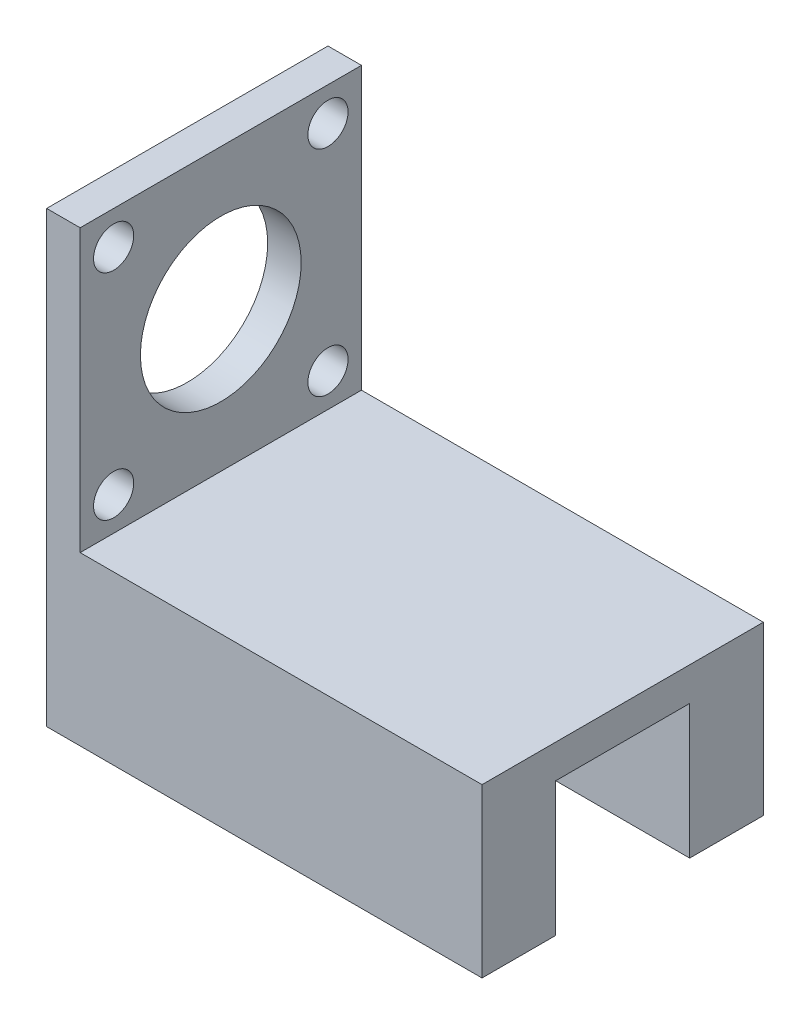
ISO-10303-21;
HEADER;
FILE_DESCRIPTION(('STEP AP214'),'2;1');
FILE_NAME('part.step','',(''),(''),'','','');
FILE_SCHEMA(('AUTOMOTIVE_DESIGN { 1 0 10303 214 1 1 1 1 }'));
ENDSEC;
DATA;
#1=APPLICATION_CONTEXT('core data for automotive mechanical design processes');
#2=APPLICATION_PROTOCOL_DEFINITION('international standard','automotive_design',2000,#1);
#3=PRODUCT_CONTEXT('',#1,'mechanical');
#4=PRODUCT('Part','Part','',(#3));
#5=PRODUCT_RELATED_PRODUCT_CATEGORY('part','',(#4));
#6=PRODUCT_DEFINITION_FORMATION('','',#4);
#7=PRODUCT_DEFINITION_CONTEXT('part definition',#1,'design');
#8=PRODUCT_DEFINITION('design','',#6,#7);
#9=PRODUCT_DEFINITION_SHAPE('','',#8);
#10=(LENGTH_UNIT() NAMED_UNIT(*) SI_UNIT(.MILLI.,.METRE.));
#11=(NAMED_UNIT(*) PLANE_ANGLE_UNIT() SI_UNIT($,.RADIAN.));
#12=(NAMED_UNIT(*) SI_UNIT($,.STERADIAN.) SOLID_ANGLE_UNIT());
#13=UNCERTAINTY_MEASURE_WITH_UNIT(LENGTH_MEASURE(1.E-05),#10,'distance_accuracy_value','');
#14=(GEOMETRIC_REPRESENTATION_CONTEXT(3) GLOBAL_UNCERTAINTY_ASSIGNED_CONTEXT((#13)) GLOBAL_UNIT_ASSIGNED_CONTEXT((#10,
#11,#12)) REPRESENTATION_CONTEXT('',''));
#15=CARTESIAN_POINT('',(0.,0.,0.));
#16=DIRECTION('',(0.,0.,1.));
#17=DIRECTION('',(1.,0.,0.));
#18=AXIS2_PLACEMENT_3D('',#15,#16,#17);
#19=CARTESIAN_POINT('',(-24.4859813084112,20.,0.));
#20=DIRECTION('',(1.,0.,0.));
#21=DIRECTION('',(0.,0.,-1.));
#22=AXIS2_PLACEMENT_3D('',#19,#20,#21);
#23=PLANE('',#22);
#24=CARTESIAN_POINT('',(-24.4859813084112,30.0000000000002,28.0264781796362));
#25=DIRECTION('',(1.,0.,0.));
#26=DIRECTION('',(0.,0.,-1.));
#27=AXIS2_PLACEMENT_3D('',#24,#25,#26);
#28=CIRCLE('',#27,3.);
#29=CARTESIAN_POINT('',(-24.4859813084112,30.0000000000002,25.0264781796362));
#30=VERTEX_POINT('',#29);
#31=EDGE_CURVE('E134',#30,#30,#28,.T.);
#32=ORIENTED_EDGE('',*,*,#31,.T.);
#33=EDGE_LOOP('',(#32));
#34=FACE_BOUND('',#33,.T.);
#35=CARTESIAN_POINT('',(-24.4859813084112,30.0000000000004,-3.97352182036384));
#36=DIRECTION('',(1.,0.,0.));
#37=DIRECTION('',(0.,0.,-1.));
#38=AXIS2_PLACEMENT_3D('',#35,#36,#37);
#39=CIRCLE('',#38,3.00000000000001);
#40=CARTESIAN_POINT('',(-24.4859813084112,30.0000000000004,-6.97352182036385));
#41=VERTEX_POINT('',#40);
#42=EDGE_CURVE('E218',#41,#41,#39,.T.);
#43=ORIENTED_EDGE('',*,*,#42,.T.);
#44=EDGE_LOOP('',(#43));
#45=FACE_BOUND('',#44,.T.);
#46=CARTESIAN_POINT('',(-24.4859813084112,62.0000000000004,-3.97352182036356));
#47=DIRECTION('',(1.,0.,0.));
#48=DIRECTION('',(0.,0.,-1.));
#49=AXIS2_PLACEMENT_3D('',#46,#47,#48);
#50=CIRCLE('',#49,3.);
#51=CARTESIAN_POINT('',(-24.4859813084112,62.0000000000004,-6.97352182036357));
#52=VERTEX_POINT('',#51);
#53=EDGE_CURVE('E221',#52,#52,#50,.T.);
#54=ORIENTED_EDGE('',*,*,#53,.T.);
#55=EDGE_LOOP('',(#54));
#56=FACE_BOUND('',#55,.T.);
#57=CARTESIAN_POINT('',(-24.4859813084112,62.,28.0264781796365));
#58=DIRECTION('',(1.,0.,0.));
#59=DIRECTION('',(0.,0.,-1.));
#60=AXIS2_PLACEMENT_3D('',#57,#58,#59);
#61=CIRCLE('',#60,3.);
#62=CARTESIAN_POINT('',(-24.4859813084112,62.,25.0264781796365));
#63=VERTEX_POINT('',#62);
#64=EDGE_CURVE('E224',#63,#63,#61,.T.);
#65=ORIENTED_EDGE('',*,*,#64,.T.);
#66=EDGE_LOOP('',(#65));
#67=FACE_BOUND('',#66,.T.);
#68=CARTESIAN_POINT('',(-24.4859813084112,46.,12.0264781796365));
#69=DIRECTION('',(1.,0.,0.));
#70=DIRECTION('',(0.,0.,-1.));
#71=AXIS2_PLACEMENT_3D('',#68,#69,#70);
#72=CIRCLE('',#71,12.);
#73=CARTESIAN_POINT('',(-24.4859813084112,46.,0.0264781796364844));
#74=VERTEX_POINT('',#73);
#75=EDGE_CURVE('E227',#74,#74,#72,.T.);
#76=ORIENTED_EDGE('',*,*,#75,.T.);
#77=EDGE_LOOP('',(#76));
#78=FACE_BOUND('',#77,.T.);
#79=DIRECTION('',(0.,0.,1.));
#80=VECTOR('',#79,1.);
#81=CARTESIAN_POINT('',(-24.4859813084112,0.,0.));
#82=LINE('',#81,#80);
#83=CARTESIAN_POINT('',(-24.4859813084112,0.,-8.97352182036352));
#84=VERTEX_POINT('',#83);
#85=CARTESIAN_POINT('',(-24.4859813084112,0.,2.02647817963648));
#86=VERTEX_POINT('',#85);
#87=EDGE_CURVE('E101',#84,#86,#82,.T.);
#88=ORIENTED_EDGE('',*,*,#87,.T.);
#89=DIRECTION('',(0.,-1.,0.));
#90=VECTOR('',#89,1.);
#91=CARTESIAN_POINT('',(-24.4859813084112,20.,2.02647817963648));
#92=LINE('',#91,#90);
#93=CARTESIAN_POINT('',(-24.4859813084112,20.,2.02647817963648));
#94=VERTEX_POINT('',#93);
#95=EDGE_CURVE('E11',#94,#86,#92,.T.);
#96=ORIENTED_EDGE('',*,*,#95,.F.);
#97=DIRECTION('',(0.,0.,1.));
#98=VECTOR('',#97,1.);
#99=CARTESIAN_POINT('',(-24.4859813084112,20.,-8.97352182036352));
#100=LINE('',#99,#98);
#101=CARTESIAN_POINT('',(-24.4859813084112,20.,22.0264781796365));
#102=VERTEX_POINT('',#101);
#103=EDGE_CURVE('E159',#94,#102,#100,.T.);
#104=ORIENTED_EDGE('',*,*,#103,.T.);
#105=DIRECTION('',(0.,-1.,0.));
#106=VECTOR('',#105,1.);
#107=CARTESIAN_POINT('',(-24.4859813084112,20.,22.0264781796365));
#108=LINE('',#107,#106);
#109=CARTESIAN_POINT('',(-24.4859813084112,0.,22.0264781796365));
#110=VERTEX_POINT('',#109);
#111=EDGE_CURVE('E142',#102,#110,#108,.T.);
#112=ORIENTED_EDGE('',*,*,#111,.T.);
#113=DIRECTION('',(0.,0.,1.));
#114=VECTOR('',#113,1.);
#115=CARTESIAN_POINT('',(-24.4859813084112,0.,0.));
#116=LINE('',#115,#114);
#117=CARTESIAN_POINT('',(-24.4859813084112,0.,33.0264781796365));
#118=VERTEX_POINT('',#117);
#119=EDGE_CURVE('E143',#110,#118,#116,.T.);
#120=ORIENTED_EDGE('',*,*,#119,.T.);
#121=DIRECTION('',(0.,-1.,0.));
#122=VECTOR('',#121,1.);
#123=CARTESIAN_POINT('',(-24.4859813084112,25.,33.0264781796365));
#124=LINE('',#123,#122);
#125=CARTESIAN_POINT('',(-24.4859813084112,67.,33.0264781796365));
#126=VERTEX_POINT('',#125);
#127=EDGE_CURVE('E172',#126,#118,#124,.T.);
#128=ORIENTED_EDGE('',*,*,#127,.F.);
#129=DIRECTION('',(0.,0.,1.));
#130=VECTOR('',#129,1.);
#131=CARTESIAN_POINT('',(-24.4859813084112,67.,33.0264781796365));
#132=LINE('',#131,#130);
#133=CARTESIAN_POINT('',(-24.4859813084112,67.,-8.97352182036352));
#134=VERTEX_POINT('',#133);
#135=EDGE_CURVE('E111',#134,#126,#132,.T.);
#136=ORIENTED_EDGE('',*,*,#135,.F.);
#137=DIRECTION('',(0.,-1.,0.));
#138=VECTOR('',#137,1.);
#139=CARTESIAN_POINT('',(-24.4859813084112,20.,-8.97352182036352));
#140=LINE('',#139,#138);
#141=EDGE_CURVE('E88',#134,#84,#140,.T.);
#142=ORIENTED_EDGE('',*,*,#141,.T.);
#143=EDGE_LOOP('',(#88,#96,#104,#112,#120,#128,#136,#142));
#144=FACE_BOUND('',#143,.T.);
#145=ADVANCED_FACE('F35',(#34,#45,#56,#67,#78,#144),#23,.F.);
#146=CARTESIAN_POINT('',(0.,20.,2.02647817963648));
#147=DIRECTION('',(0.,0.,-1.));
#148=DIRECTION('',(-1.,0.,0.));
#149=AXIS2_PLACEMENT_3D('',#146,#147,#148);
#150=PLANE('',#149);
#151=DIRECTION('',(1.,0.,0.));
#152=VECTOR('',#151,1.);
#153=CARTESIAN_POINT('',(0.,0.,2.02647817963648));
#154=LINE('',#153,#152);
#155=CARTESIAN_POINT('',(40.5140186915888,0.,2.02647817963648));
#156=VERTEX_POINT('',#155);
#157=EDGE_CURVE('E96',#86,#156,#154,.T.);
#158=ORIENTED_EDGE('',*,*,#157,.T.);
#159=DIRECTION('',(0.,-1.,0.));
#160=VECTOR('',#159,1.);
#161=CARTESIAN_POINT('',(40.5140186915888,20.,2.02647817963648));
#162=LINE('',#161,#160);
#163=CARTESIAN_POINT('',(40.5140186915888,20.,2.02647817963648));
#164=VERTEX_POINT('',#163);
#165=EDGE_CURVE('E42',#164,#156,#162,.T.);
#166=ORIENTED_EDGE('',*,*,#165,.F.);
#167=DIRECTION('',(1.,0.,0.));
#168=VECTOR('',#167,1.);
#169=CARTESIAN_POINT('',(0.,20.,2.02647817963648));
#170=LINE('',#169,#168);
#171=EDGE_CURVE('E57',#94,#164,#170,.T.);
#172=ORIENTED_EDGE('',*,*,#171,.F.);
#173=ORIENTED_EDGE('',*,*,#95,.T.);
#174=EDGE_LOOP('',(#158,#166,#172,#173));
#175=FACE_BOUND('',#174,.T.);
#176=ADVANCED_FACE('F175',(#175),#150,.F.);
#177=CARTESIAN_POINT('',(40.5140186915888,20.,0.));
#178=DIRECTION('',(1.,0.,0.));
#179=DIRECTION('',(0.,0.,-1.));
#180=AXIS2_PLACEMENT_3D('',#177,#178,#179);
#181=PLANE('',#180);
#182=DIRECTION('',(0.,0.,1.));
#183=VECTOR('',#182,1.);
#184=CARTESIAN_POINT('',(40.5140186915888,0.,0.));
#185=LINE('',#184,#183);
#186=CARTESIAN_POINT('',(40.5140186915888,0.,-8.97352182036352));
#187=VERTEX_POINT('',#186);
#188=EDGE_CURVE('E91',#187,#156,#185,.T.);
#189=ORIENTED_EDGE('',*,*,#188,.F.);
#190=DIRECTION('',(0.,-1.,0.));
#191=VECTOR('',#190,1.);
#192=CARTESIAN_POINT('',(40.5140186915888,20.,-8.97352182036352));
#193=LINE('',#192,#191);
#194=CARTESIAN_POINT('',(40.5140186915888,25.,-8.97352182036352));
#195=VERTEX_POINT('',#194);
#196=EDGE_CURVE('E76',#195,#187,#193,.T.);
#197=ORIENTED_EDGE('',*,*,#196,.F.);
#198=DIRECTION('',(0.,0.,-1.));
#199=VECTOR('',#198,1.);
#200=CARTESIAN_POINT('',(40.5140186915888,25.,-8.97352182036352));
#201=LINE('',#200,#199);
#202=CARTESIAN_POINT('',(40.5140186915888,25.,33.0264781796365));
#203=VERTEX_POINT('',#202);
#204=EDGE_CURVE('E162',#203,#195,#201,.T.);
#205=ORIENTED_EDGE('',*,*,#204,.F.);
#206=DIRECTION('',(0.,-1.,0.));
#207=VECTOR('',#206,1.);
#208=CARTESIAN_POINT('',(40.5140186915888,25.,33.0264781796365));
#209=LINE('',#208,#207);
#210=CARTESIAN_POINT('',(40.5140186915888,0.,33.0264781796365));
#211=VERTEX_POINT('',#210);
#212=EDGE_CURVE('E166',#203,#211,#209,.T.);
#213=ORIENTED_EDGE('',*,*,#212,.T.);
#214=DIRECTION('',(0.,0.,-1.));
#215=VECTOR('',#214,1.);
#216=CARTESIAN_POINT('',(40.5140186915888,0.,0.));
#217=LINE('',#216,#215);
#218=CARTESIAN_POINT('',(40.5140186915888,0.,22.0264781796365));
#219=VERTEX_POINT('',#218);
#220=EDGE_CURVE('E146',#211,#219,#217,.T.);
#221=ORIENTED_EDGE('',*,*,#220,.T.);
#222=DIRECTION('',(0.,-1.,0.));
#223=VECTOR('',#222,1.);
#224=CARTESIAN_POINT('',(40.5140186915888,20.,22.0264781796365));
#225=LINE('',#224,#223);
#226=CARTESIAN_POINT('',(40.5140186915888,20.,22.0264781796365));
#227=VERTEX_POINT('',#226);
#228=EDGE_CURVE('E156',#227,#219,#225,.T.);
#229=ORIENTED_EDGE('',*,*,#228,.F.);
#230=DIRECTION('',(0.,0.,-1.));
#231=VECTOR('',#230,1.);
#232=CARTESIAN_POINT('',(40.5140186915888,20.,-8.97352182036352));
#233=LINE('',#232,#231);
#234=EDGE_CURVE('E163',#227,#164,#233,.T.);
#235=ORIENTED_EDGE('',*,*,#234,.T.);
#236=ORIENTED_EDGE('',*,*,#165,.T.);
#237=EDGE_LOOP('',(#189,#197,#205,#213,#221,#229,#235,#236));
#238=FACE_BOUND('',#237,.T.);
#239=ADVANCED_FACE('F92',(#238),#181,.T.);
#240=CARTESIAN_POINT('',(0.,20.,-8.97352182036352));
#241=DIRECTION('',(0.,0.,-1.));
#242=DIRECTION('',(-1.,0.,0.));
#243=AXIS2_PLACEMENT_3D('',#240,#241,#242);
#244=PLANE('',#243);
#245=DIRECTION('',(1.,0.,0.));
#246=VECTOR('',#245,1.);
#247=CARTESIAN_POINT('',(0.,0.,-8.97352182036352));
#248=LINE('',#247,#246);
#249=EDGE_CURVE('E81',#84,#187,#248,.T.);
#250=ORIENTED_EDGE('',*,*,#249,.F.);
#251=ORIENTED_EDGE('',*,*,#141,.F.);
#252=DIRECTION('',(-1.,0.,0.));
#253=VECTOR('',#252,1.);
#254=CARTESIAN_POINT('',(-24.4859813084112,67.,-8.97352182036352));
#255=LINE('',#254,#253);
#256=CARTESIAN_POINT('',(-19.4859813084112,67.,-8.97352182036352));
#257=VERTEX_POINT('',#256);
#258=EDGE_CURVE('E115',#257,#134,#255,.T.);
#259=ORIENTED_EDGE('',*,*,#258,.F.);
#260=DIRECTION('',(0.,-1.,0.));
#261=VECTOR('',#260,1.);
#262=CARTESIAN_POINT('',(-19.4859813084112,67.,-8.97352182036352));
#263=LINE('',#262,#261);
#264=CARTESIAN_POINT('',(-19.4859813084112,25.,-8.97352182036352));
#265=VERTEX_POINT('',#264);
#266=EDGE_CURVE('E126',#257,#265,#263,.T.);
#267=ORIENTED_EDGE('',*,*,#266,.T.);
#268=DIRECTION('',(-1.,0.,0.));
#269=VECTOR('',#268,1.);
#270=CARTESIAN_POINT('',(-24.4859813084112,25.,-8.97352182036352));
#271=LINE('',#270,#269);
#272=EDGE_CURVE('E84',#195,#265,#271,.T.);
#273=ORIENTED_EDGE('',*,*,#272,.F.);
#274=ORIENTED_EDGE('',*,*,#196,.T.);
#275=EDGE_LOOP('',(#250,#251,#259,#267,#273,#274));
#276=FACE_BOUND('',#275,.T.);
#277=ADVANCED_FACE('F78',(#276),#244,.T.);
#278=CARTESIAN_POINT('',(0.,0.,0.));
#279=DIRECTION('',(0.,1.,0.));
#280=DIRECTION('',(0.,0.,1.));
#281=AXIS2_PLACEMENT_3D('',#278,#279,#280);
#282=PLANE('',#281);
#283=ORIENTED_EDGE('',*,*,#87,.F.);
#284=ORIENTED_EDGE('',*,*,#249,.T.);
#285=ORIENTED_EDGE('',*,*,#188,.T.);
#286=ORIENTED_EDGE('',*,*,#157,.F.);
#287=EDGE_LOOP('',(#283,#284,#285,#286));
#288=FACE_BOUND('',#287,.T.);
#289=ADVANCED_FACE('F99',(#288),#282,.F.);
#290=CARTESIAN_POINT('',(0.,20.,0.));
#291=DIRECTION('',(0.,1.,0.));
#292=DIRECTION('',(0.,0.,1.));
#293=AXIS2_PLACEMENT_3D('',#290,#291,#292);
#294=PLANE('',#293);
#295=ORIENTED_EDGE('',*,*,#234,.F.);
#296=DIRECTION('',(1.,0.,0.));
#297=VECTOR('',#296,1.);
#298=CARTESIAN_POINT('',(0.,20.,22.0264781796365));
#299=LINE('',#298,#297);
#300=EDGE_CURVE('E139',#102,#227,#299,.T.);
#301=ORIENTED_EDGE('',*,*,#300,.F.);
#302=ORIENTED_EDGE('',*,*,#103,.F.);
#303=ORIENTED_EDGE('',*,*,#171,.T.);
#304=EDGE_LOOP('',(#295,#301,#302,#303));
#305=FACE_BOUND('',#304,.T.);
#306=ADVANCED_FACE('F181',(#305),#294,.F.);
#307=CARTESIAN_POINT('',(-24.4859813084112,25.,33.0264781796365));
#308=DIRECTION('',(0.,0.,-1.));
#309=DIRECTION('',(-1.,0.,0.));
#310=AXIS2_PLACEMENT_3D('',#307,#308,#309);
#311=PLANE('',#310);
#312=ORIENTED_EDGE('',*,*,#127,.T.);
#313=DIRECTION('',(1.,0.,0.));
#314=VECTOR('',#313,1.);
#315=CARTESIAN_POINT('',(0.,0.,33.0264781796365));
#316=LINE('',#315,#314);
#317=EDGE_CURVE('E138',#118,#211,#316,.T.);
#318=ORIENTED_EDGE('',*,*,#317,.T.);
#319=ORIENTED_EDGE('',*,*,#212,.F.);
#320=DIRECTION('',(1.,0.,0.));
#321=VECTOR('',#320,1.);
#322=CARTESIAN_POINT('',(-24.4859813084112,25.,33.0264781796365));
#323=LINE('',#322,#321);
#324=CARTESIAN_POINT('',(-19.4859813084112,25.,33.0264781796365));
#325=VERTEX_POINT('',#324);
#326=EDGE_CURVE('E160',#325,#203,#323,.T.);
#327=ORIENTED_EDGE('',*,*,#326,.F.);
#328=DIRECTION('',(0.,-1.,0.));
#329=VECTOR('',#328,1.);
#330=CARTESIAN_POINT('',(-19.4859813084112,67.,33.0264781796365));
#331=LINE('',#330,#329);
#332=CARTESIAN_POINT('',(-19.4859813084112,67.,33.0264781796365));
#333=VERTEX_POINT('',#332);
#334=EDGE_CURVE('E128',#333,#325,#331,.T.);
#335=ORIENTED_EDGE('',*,*,#334,.F.);
#336=DIRECTION('',(1.,0.,0.));
#337=VECTOR('',#336,1.);
#338=CARTESIAN_POINT('',(-24.4859813084112,67.,33.0264781796365));
#339=LINE('',#338,#337);
#340=EDGE_CURVE('E130',#126,#333,#339,.T.);
#341=ORIENTED_EDGE('',*,*,#340,.F.);
#342=EDGE_LOOP('',(#312,#318,#319,#327,#335,#341));
#343=FACE_BOUND('',#342,.T.);
#344=ADVANCED_FACE('F205',(#343),#311,.F.);
#345=CARTESIAN_POINT('',(0.,25.,0.));
#346=DIRECTION('',(0.,1.,0.));
#347=DIRECTION('',(0.,0.,1.));
#348=AXIS2_PLACEMENT_3D('',#345,#346,#347);
#349=PLANE('',#348);
#350=DIRECTION('',(0.,0.,-1.));
#351=VECTOR('',#350,1.);
#352=CARTESIAN_POINT('',(-19.4859813084112,25.,33.0264781796365));
#353=LINE('',#352,#351);
#354=EDGE_CURVE('E49',#325,#265,#353,.T.);
#355=ORIENTED_EDGE('',*,*,#354,.F.);
#356=ORIENTED_EDGE('',*,*,#326,.T.);
#357=ORIENTED_EDGE('',*,*,#204,.T.);
#358=ORIENTED_EDGE('',*,*,#272,.T.);
#359=EDGE_LOOP('',(#355,#356,#357,#358));
#360=FACE_BOUND('',#359,.T.);
#361=ADVANCED_FACE('F202',(#360),#349,.T.);
#362=CARTESIAN_POINT('',(0.,20.,22.0264781796365));
#363=DIRECTION('',(0.,0.,-1.));
#364=DIRECTION('',(-1.,0.,0.));
#365=AXIS2_PLACEMENT_3D('',#362,#363,#364);
#366=PLANE('',#365);
#367=DIRECTION('',(1.,0.,0.));
#368=VECTOR('',#367,1.);
#369=CARTESIAN_POINT('',(0.,0.,22.0264781796365));
#370=LINE('',#369,#368);
#371=EDGE_CURVE('E149',#110,#219,#370,.T.);
#372=ORIENTED_EDGE('',*,*,#371,.F.);
#373=ORIENTED_EDGE('',*,*,#111,.F.);
#374=ORIENTED_EDGE('',*,*,#300,.T.);
#375=ORIENTED_EDGE('',*,*,#228,.T.);
#376=EDGE_LOOP('',(#372,#373,#374,#375));
#377=FACE_BOUND('',#376,.T.);
#378=ADVANCED_FACE('F188',(#377),#366,.T.);
#379=CARTESIAN_POINT('',(0.,0.,0.));
#380=DIRECTION('',(0.,1.,0.));
#381=DIRECTION('',(0.,0.,1.));
#382=AXIS2_PLACEMENT_3D('',#379,#380,#381);
#383=PLANE('',#382);
#384=ORIENTED_EDGE('',*,*,#317,.F.);
#385=ORIENTED_EDGE('',*,*,#119,.F.);
#386=ORIENTED_EDGE('',*,*,#371,.T.);
#387=ORIENTED_EDGE('',*,*,#220,.F.);
#388=EDGE_LOOP('',(#384,#385,#386,#387));
#389=FACE_BOUND('',#388,.T.);
#390=ADVANCED_FACE('F209',(#389),#383,.F.);
#391=CARTESIAN_POINT('',(-19.4859813084112,67.,33.0264781796365));
#392=DIRECTION('',(-1.,0.,0.));
#393=DIRECTION('',(0.,0.,1.));
#394=AXIS2_PLACEMENT_3D('',#391,#392,#393);
#395=PLANE('',#394);
#396=CARTESIAN_POINT('',(-19.4859813084112,30.0000000000002,28.0264781796362));
#397=DIRECTION('',(1.,0.,0.));
#398=DIRECTION('',(0.,0.,-1.));
#399=AXIS2_PLACEMENT_3D('',#396,#397,#398);
#400=CIRCLE('',#399,3.);
#401=CARTESIAN_POINT('',(-19.4859813084112,30.0000000000002,25.0264781796362));
#402=VERTEX_POINT('',#401);
#403=EDGE_CURVE('E234',#402,#402,#400,.T.);
#404=ORIENTED_EDGE('',*,*,#403,.F.);
#405=EDGE_LOOP('',(#404));
#406=FACE_BOUND('',#405,.T.);
#407=CARTESIAN_POINT('',(-19.4859813084112,30.0000000000004,-3.97352182036384));
#408=DIRECTION('',(1.,0.,0.));
#409=DIRECTION('',(0.,0.,-1.));
#410=AXIS2_PLACEMENT_3D('',#407,#408,#409);
#411=CIRCLE('',#410,3.00000000000001);
#412=CARTESIAN_POINT('',(-19.4859813084112,30.0000000000004,-6.97352182036385));
#413=VERTEX_POINT('',#412);
#414=EDGE_CURVE('E237',#413,#413,#411,.T.);
#415=ORIENTED_EDGE('',*,*,#414,.F.);
#416=EDGE_LOOP('',(#415));
#417=FACE_BOUND('',#416,.T.);
#418=CARTESIAN_POINT('',(-19.4859813084112,62.0000000000004,-3.97352182036356));
#419=DIRECTION('',(1.,0.,0.));
#420=DIRECTION('',(0.,0.,-1.));
#421=AXIS2_PLACEMENT_3D('',#418,#419,#420);
#422=CIRCLE('',#421,3.);
#423=CARTESIAN_POINT('',(-19.4859813084112,62.0000000000004,-6.97352182036357));
#424=VERTEX_POINT('',#423);
#425=EDGE_CURVE('E240',#424,#424,#422,.T.);
#426=ORIENTED_EDGE('',*,*,#425,.F.);
#427=EDGE_LOOP('',(#426));
#428=FACE_BOUND('',#427,.T.);
#429=CARTESIAN_POINT('',(-19.4859813084112,62.,28.0264781796365));
#430=DIRECTION('',(1.,0.,0.));
#431=DIRECTION('',(0.,0.,-1.));
#432=AXIS2_PLACEMENT_3D('',#429,#430,#431);
#433=CIRCLE('',#432,3.);
#434=CARTESIAN_POINT('',(-19.4859813084112,62.,25.0264781796365));
#435=VERTEX_POINT('',#434);
#436=EDGE_CURVE('E233',#435,#435,#433,.T.);
#437=ORIENTED_EDGE('',*,*,#436,.F.);
#438=EDGE_LOOP('',(#437));
#439=FACE_BOUND('',#438,.T.);
#440=CARTESIAN_POINT('',(-19.4859813084112,46.,12.0264781796365));
#441=DIRECTION('',(1.,0.,0.));
#442=DIRECTION('',(0.,0.,-1.));
#443=AXIS2_PLACEMENT_3D('',#440,#441,#442);
#444=CIRCLE('',#443,12.);
#445=CARTESIAN_POINT('',(-19.4859813084112,46.,0.0264781796364844));
#446=VERTEX_POINT('',#445);
#447=EDGE_CURVE('E230',#446,#446,#444,.T.);
#448=ORIENTED_EDGE('',*,*,#447,.F.);
#449=EDGE_LOOP('',(#448));
#450=FACE_BOUND('',#449,.T.);
#451=ORIENTED_EDGE('',*,*,#354,.T.);
#452=ORIENTED_EDGE('',*,*,#266,.F.);
#453=DIRECTION('',(0.,0.,-1.));
#454=VECTOR('',#453,1.);
#455=CARTESIAN_POINT('',(-19.4859813084112,67.,33.0264781796365));
#456=LINE('',#455,#454);
#457=EDGE_CURVE('E124',#333,#257,#456,.T.);
#458=ORIENTED_EDGE('',*,*,#457,.F.);
#459=ORIENTED_EDGE('',*,*,#334,.T.);
#460=EDGE_LOOP('',(#451,#452,#458,#459));
#461=FACE_BOUND('',#460,.T.);
#462=ADVANCED_FACE('F249',(#406,#417,#428,#439,#450,#461),#395,.F.);
#463=CARTESIAN_POINT('',(0.,67.,0.));
#464=DIRECTION('',(0.,-1.,0.));
#465=DIRECTION('',(0.,0.,-1.));
#466=AXIS2_PLACEMENT_3D('',#463,#464,#465);
#467=PLANE('',#466);
#468=ORIENTED_EDGE('',*,*,#135,.T.);
#469=ORIENTED_EDGE('',*,*,#340,.T.);
#470=ORIENTED_EDGE('',*,*,#457,.T.);
#471=ORIENTED_EDGE('',*,*,#258,.T.);
#472=EDGE_LOOP('',(#468,#469,#470,#471));
#473=FACE_BOUND('',#472,.T.);
#474=ADVANCED_FACE('F120',(#473),#467,.F.);
#475=CARTESIAN_POINT('',(-61.4859813084112,46.,12.0264781796365));
#476=DIRECTION('',(1.,0.,0.));
#477=DIRECTION('',(0.,0.,-1.));
#478=AXIS2_PLACEMENT_3D('',#475,#476,#477);
#479=CYLINDRICAL_SURFACE('',#478,12.);
#480=ORIENTED_EDGE('',*,*,#447,.T.);
#481=EDGE_LOOP('',(#480));
#482=FACE_BOUND('',#481,.T.);
#483=ORIENTED_EDGE('',*,*,#75,.F.);
#484=EDGE_LOOP('',(#483));
#485=FACE_BOUND('',#484,.T.);
#486=ADVANCED_FACE('F259',(#482,#485),#479,.F.);
#487=CARTESIAN_POINT('',(-61.4859813084112,62.,28.0264781796365));
#488=DIRECTION('',(1.,0.,0.));
#489=DIRECTION('',(0.,0.,-1.));
#490=AXIS2_PLACEMENT_3D('',#487,#488,#489);
#491=CYLINDRICAL_SURFACE('',#490,3.);
#492=ORIENTED_EDGE('',*,*,#436,.T.);
#493=EDGE_LOOP('',(#492));
#494=FACE_BOUND('',#493,.T.);
#495=ORIENTED_EDGE('',*,*,#64,.F.);
#496=EDGE_LOOP('',(#495));
#497=FACE_BOUND('',#496,.T.);
#498=ADVANCED_FACE('F246',(#494,#497),#491,.F.);
#499=CARTESIAN_POINT('',(-61.4859813084112,62.0000000000004,-3.97352182036356));
#500=DIRECTION('',(1.,0.,0.));
#501=DIRECTION('',(0.,0.,-1.));
#502=AXIS2_PLACEMENT_3D('',#499,#500,#501);
#503=CYLINDRICAL_SURFACE('',#502,3.);
#504=ORIENTED_EDGE('',*,*,#425,.T.);
#505=EDGE_LOOP('',(#504));
#506=FACE_BOUND('',#505,.T.);
#507=ORIENTED_EDGE('',*,*,#53,.F.);
#508=EDGE_LOOP('',(#507));
#509=FACE_BOUND('',#508,.T.);
#510=ADVANCED_FACE('F278',(#506,#509),#503,.F.);
#511=CARTESIAN_POINT('',(-61.4859813084112,30.0000000000004,-3.97352182036384));
#512=DIRECTION('',(1.,0.,0.));
#513=DIRECTION('',(0.,0.,-1.));
#514=AXIS2_PLACEMENT_3D('',#511,#512,#513);
#515=CYLINDRICAL_SURFACE('',#514,3.00000000000001);
#516=ORIENTED_EDGE('',*,*,#414,.T.);
#517=EDGE_LOOP('',(#516));
#518=FACE_BOUND('',#517,.T.);
#519=ORIENTED_EDGE('',*,*,#42,.F.);
#520=EDGE_LOOP('',(#519));
#521=FACE_BOUND('',#520,.T.);
#522=ADVANCED_FACE('F283',(#518,#521),#515,.F.);
#523=CARTESIAN_POINT('',(-61.4859813084112,30.0000000000002,28.0264781796362));
#524=DIRECTION('',(1.,0.,0.));
#525=DIRECTION('',(0.,0.,-1.));
#526=AXIS2_PLACEMENT_3D('',#523,#524,#525);
#527=CYLINDRICAL_SURFACE('',#526,3.);
#528=ORIENTED_EDGE('',*,*,#403,.T.);
#529=EDGE_LOOP('',(#528));
#530=FACE_BOUND('',#529,.T.);
#531=ORIENTED_EDGE('',*,*,#31,.F.);
#532=EDGE_LOOP('',(#531));
#533=FACE_BOUND('',#532,.T.);
#534=ADVANCED_FACE('F289',(#530,#533),#527,.F.);
#535=CLOSED_SHELL('',(#145,#176,#239,#277,#289,#306,#344,#361,#378,#390,#462,#474,#486,#498,
#510,#522,#534));
#536=MANIFOLD_SOLID_BREP('B2',#535);
#537=ADVANCED_BREP_SHAPE_REPRESENTATION('',(#18,#536),#14);
#538=SHAPE_DEFINITION_REPRESENTATION(#9,#537);
ENDSEC;
END-ISO-10303-21;
